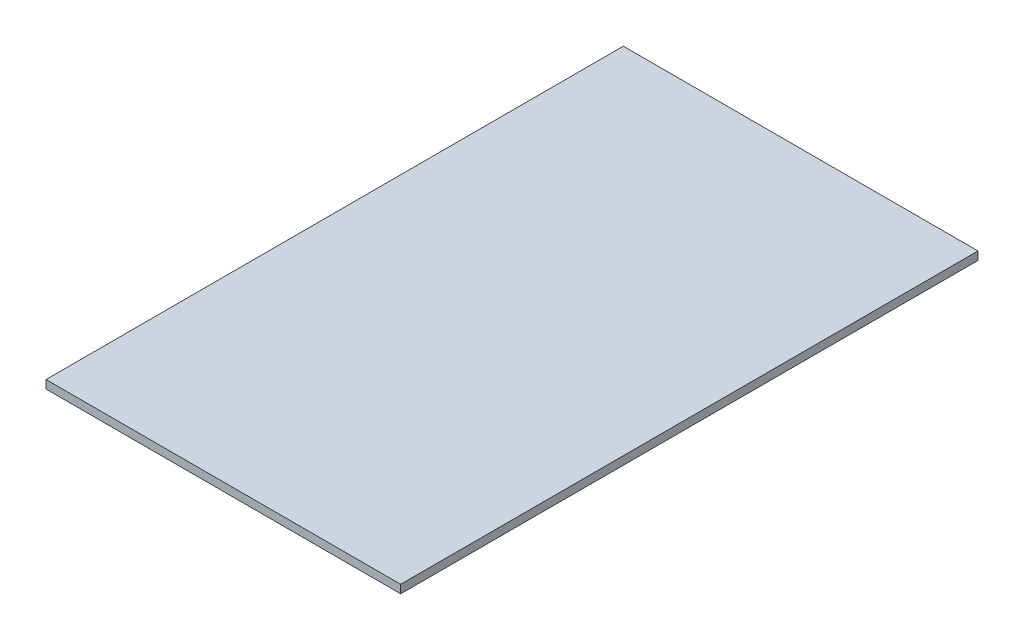
ISO-10303-21;
HEADER;
FILE_DESCRIPTION(('STEP AP214'),'2;1');
FILE_NAME('part.step','',(''),(''),'','','');
FILE_SCHEMA(('AUTOMOTIVE_DESIGN { 1 0 10303 214 1 1 1 1 }'));
ENDSEC;
DATA;
#1=APPLICATION_CONTEXT('core data for automotive mechanical design processes');
#2=APPLICATION_PROTOCOL_DEFINITION('international standard','automotive_design',2000,#1);
#3=PRODUCT_CONTEXT('',#1,'mechanical');
#4=PRODUCT('Part','Part','',(#3));
#5=PRODUCT_RELATED_PRODUCT_CATEGORY('part','',(#4));
#6=PRODUCT_DEFINITION_FORMATION('','',#4);
#7=PRODUCT_DEFINITION_CONTEXT('part definition',#1,'design');
#8=PRODUCT_DEFINITION('design','',#6,#7);
#9=PRODUCT_DEFINITION_SHAPE('','',#8);
#10=(LENGTH_UNIT() NAMED_UNIT(*) SI_UNIT(.MILLI.,.METRE.));
#11=(NAMED_UNIT(*) PLANE_ANGLE_UNIT() SI_UNIT($,.RADIAN.));
#12=(NAMED_UNIT(*) SI_UNIT($,.STERADIAN.) SOLID_ANGLE_UNIT());
#13=UNCERTAINTY_MEASURE_WITH_UNIT(LENGTH_MEASURE(1.E-05),#10,'distance_accuracy_value','');
#14=(GEOMETRIC_REPRESENTATION_CONTEXT(3) GLOBAL_UNCERTAINTY_ASSIGNED_CONTEXT((#13)) GLOBAL_UNIT_ASSIGNED_CONTEXT((#10,
#11,#12)) REPRESENTATION_CONTEXT('',''));
#15=CARTESIAN_POINT('',(0.,0.,0.));
#16=DIRECTION('',(0.,0.,1.));
#17=DIRECTION('',(1.,0.,0.));
#18=AXIS2_PLACEMENT_3D('',#15,#16,#17);
#19=CARTESIAN_POINT('',(-2.22727272727273,3.175,-2.88068181818182));
#20=DIRECTION('',(1.,0.,0.));
#21=DIRECTION('',(0.,0.,-1.));
#22=AXIS2_PLACEMENT_3D('',#19,#20,#21);
#23=PLANE('',#22);
#24=DIRECTION('',(0.,0.,1.));
#25=VECTOR('',#24,1.);
#26=CARTESIAN_POINT('',(-2.22727272727273,0.,-2.88068181818182));
#27=LINE('',#26,#25);
#28=CARTESIAN_POINT('',(-2.22727272727273,0.,-2.88068181818182));
#29=VERTEX_POINT('',#28);
#30=CARTESIAN_POINT('',(-2.2272727272727,0.,219.369318181818));
#31=VERTEX_POINT('',#30);
#32=EDGE_CURVE('E96',#29,#31,#27,.T.);
#33=ORIENTED_EDGE('',*,*,#32,.T.);
#34=DIRECTION('',(0.,-1.,0.));
#35=VECTOR('',#34,1.);
#36=CARTESIAN_POINT('',(-2.2272727272727,3.175,219.369318181818));
#37=LINE('',#36,#35);
#38=CARTESIAN_POINT('',(-2.2272727272727,3.175,219.369318181818));
#39=VERTEX_POINT('',#38);
#40=EDGE_CURVE('E11',#39,#31,#37,.T.);
#41=ORIENTED_EDGE('',*,*,#40,.F.);
#42=DIRECTION('',(0.,0.,1.));
#43=VECTOR('',#42,1.);
#44=CARTESIAN_POINT('',(-2.22727272727273,3.175,-2.88068181818182));
#45=LINE('',#44,#43);
#46=CARTESIAN_POINT('',(-2.22727272727273,3.175,-2.88068181818182));
#47=VERTEX_POINT('',#46);
#48=EDGE_CURVE('E84',#47,#39,#45,.T.);
#49=ORIENTED_EDGE('',*,*,#48,.F.);
#50=DIRECTION('',(0.,-1.,0.));
#51=VECTOR('',#50,1.);
#52=CARTESIAN_POINT('',(-2.22727272727273,3.175,-2.88068181818182));
#53=LINE('',#52,#51);
#54=EDGE_CURVE('E92',#47,#29,#53,.T.);
#55=ORIENTED_EDGE('',*,*,#54,.T.);
#56=EDGE_LOOP('',(#33,#41,#49,#55));
#57=FACE_BOUND('',#56,.T.);
#58=ADVANCED_FACE('F33',(#57),#23,.F.);
#59=CARTESIAN_POINT('',(-2.2272727272727,3.175,219.369318181818));
#60=DIRECTION('',(0.,0.,-1.));
#61=DIRECTION('',(-1.,0.,0.));
#62=AXIS2_PLACEMENT_3D('',#59,#60,#61);
#63=PLANE('',#62);
#64=DIRECTION('',(1.,0.,0.));
#65=VECTOR('',#64,1.);
#66=CARTESIAN_POINT('',(-2.2272727272727,0.,219.369318181818));
#67=LINE('',#66,#65);
#68=CARTESIAN_POINT('',(134.297727272727,0.,219.369318181818));
#69=VERTEX_POINT('',#68);
#70=EDGE_CURVE('E88',#31,#69,#67,.T.);
#71=ORIENTED_EDGE('',*,*,#70,.T.);
#72=DIRECTION('',(0.,-1.,0.));
#73=VECTOR('',#72,1.);
#74=CARTESIAN_POINT('',(134.297727272727,3.175,219.369318181818));
#75=LINE('',#74,#73);
#76=CARTESIAN_POINT('',(134.297727272727,3.175,219.369318181818));
#77=VERTEX_POINT('',#76);
#78=EDGE_CURVE('E41',#77,#69,#75,.T.);
#79=ORIENTED_EDGE('',*,*,#78,.F.);
#80=DIRECTION('',(1.,0.,0.));
#81=VECTOR('',#80,1.);
#82=CARTESIAN_POINT('',(-2.2272727272727,3.175,219.369318181818));
#83=LINE('',#82,#81);
#84=EDGE_CURVE('E79',#39,#77,#83,.T.);
#85=ORIENTED_EDGE('',*,*,#84,.F.);
#86=ORIENTED_EDGE('',*,*,#40,.T.);
#87=EDGE_LOOP('',(#71,#79,#85,#86));
#88=FACE_BOUND('',#87,.T.);
#89=ADVANCED_FACE('F87',(#88),#63,.F.);
#90=CARTESIAN_POINT('',(134.297727272727,3.175,-2.88068181818182));
#91=DIRECTION('',(-1.,0.,0.));
#92=DIRECTION('',(0.,0.,1.));
#93=AXIS2_PLACEMENT_3D('',#90,#91,#92);
#94=PLANE('',#93);
#95=DIRECTION('',(0.,0.,-1.));
#96=VECTOR('',#95,1.);
#97=CARTESIAN_POINT('',(134.297727272727,0.,-2.88068181818182));
#98=LINE('',#97,#96);
#99=CARTESIAN_POINT('',(134.297727272727,0.,-2.88068181818182));
#100=VERTEX_POINT('',#99);
#101=EDGE_CURVE('E66',#69,#100,#98,.T.);
#102=ORIENTED_EDGE('',*,*,#101,.T.);
#103=DIRECTION('',(0.,-1.,0.));
#104=VECTOR('',#103,1.);
#105=CARTESIAN_POINT('',(134.297727272727,3.175,-2.88068181818182));
#106=LINE('',#105,#104);
#107=CARTESIAN_POINT('',(134.297727272727,3.175,-2.88068181818182));
#108=VERTEX_POINT('',#107);
#109=EDGE_CURVE('E89',#108,#100,#106,.T.);
#110=ORIENTED_EDGE('',*,*,#109,.F.);
#111=DIRECTION('',(0.,0.,-1.));
#112=VECTOR('',#111,1.);
#113=CARTESIAN_POINT('',(134.297727272727,3.175,-2.88068181818182));
#114=LINE('',#113,#112);
#115=EDGE_CURVE('E82',#77,#108,#114,.T.);
#116=ORIENTED_EDGE('',*,*,#115,.F.);
#117=ORIENTED_EDGE('',*,*,#78,.T.);
#118=EDGE_LOOP('',(#102,#110,#116,#117));
#119=FACE_BOUND('',#118,.T.);
#120=ADVANCED_FACE('F90',(#119),#94,.F.);
#121=CARTESIAN_POINT('',(-2.22727272727273,3.175,-2.88068181818182));
#122=DIRECTION('',(0.,0.,1.));
#123=DIRECTION('',(1.,0.,0.));
#124=AXIS2_PLACEMENT_3D('',#121,#122,#123);
#125=PLANE('',#124);
#126=DIRECTION('',(-1.,0.,0.));
#127=VECTOR('',#126,1.);
#128=CARTESIAN_POINT('',(-2.22727272727273,0.,-2.88068181818182));
#129=LINE('',#128,#127);
#130=EDGE_CURVE('E72',#100,#29,#129,.T.);
#131=ORIENTED_EDGE('',*,*,#130,.T.);
#132=ORIENTED_EDGE('',*,*,#54,.F.);
#133=DIRECTION('',(-1.,0.,0.));
#134=VECTOR('',#133,1.);
#135=CARTESIAN_POINT('',(-2.22727272727273,3.175,-2.88068181818182));
#136=LINE('',#135,#134);
#137=EDGE_CURVE('E49',#108,#47,#136,.T.);
#138=ORIENTED_EDGE('',*,*,#137,.F.);
#139=ORIENTED_EDGE('',*,*,#109,.T.);
#140=EDGE_LOOP('',(#131,#132,#138,#139));
#141=FACE_BOUND('',#140,.T.);
#142=ADVANCED_FACE('F103',(#141),#125,.F.);
#143=CARTESIAN_POINT('',(0.,3.175,0.));
#144=DIRECTION('',(0.,1.,0.));
#145=DIRECTION('',(0.,0.,1.));
#146=AXIS2_PLACEMENT_3D('',#143,#144,#145);
#147=PLANE('',#146);
#148=ORIENTED_EDGE('',*,*,#48,.T.);
#149=ORIENTED_EDGE('',*,*,#84,.T.);
#150=ORIENTED_EDGE('',*,*,#115,.T.);
#151=ORIENTED_EDGE('',*,*,#137,.T.);
#152=EDGE_LOOP('',(#148,#149,#150,#151));
#153=FACE_BOUND('',#152,.T.);
#154=ADVANCED_FACE('F80',(#153),#147,.T.);
#155=CARTESIAN_POINT('',(0.,0.,0.));
#156=DIRECTION('',(0.,1.,0.));
#157=DIRECTION('',(0.,0.,1.));
#158=AXIS2_PLACEMENT_3D('',#155,#156,#157);
#159=PLANE('',#158);
#160=ORIENTED_EDGE('',*,*,#32,.F.);
#161=ORIENTED_EDGE('',*,*,#130,.F.);
#162=ORIENTED_EDGE('',*,*,#101,.F.);
#163=ORIENTED_EDGE('',*,*,#70,.F.);
#164=EDGE_LOOP('',(#160,#161,#162,#163));
#165=FACE_BOUND('',#164,.T.);
#166=ADVANCED_FACE('F106',(#165),#159,.F.);
#167=CLOSED_SHELL('',(#58,#89,#120,#142,#154,#166));
#168=MANIFOLD_SOLID_BREP('B2',#167);
#169=ADVANCED_BREP_SHAPE_REPRESENTATION('',(#18,#168),#14);
#170=SHAPE_DEFINITION_REPRESENTATION(#9,#169);
ENDSEC;
END-ISO-10303-21;
